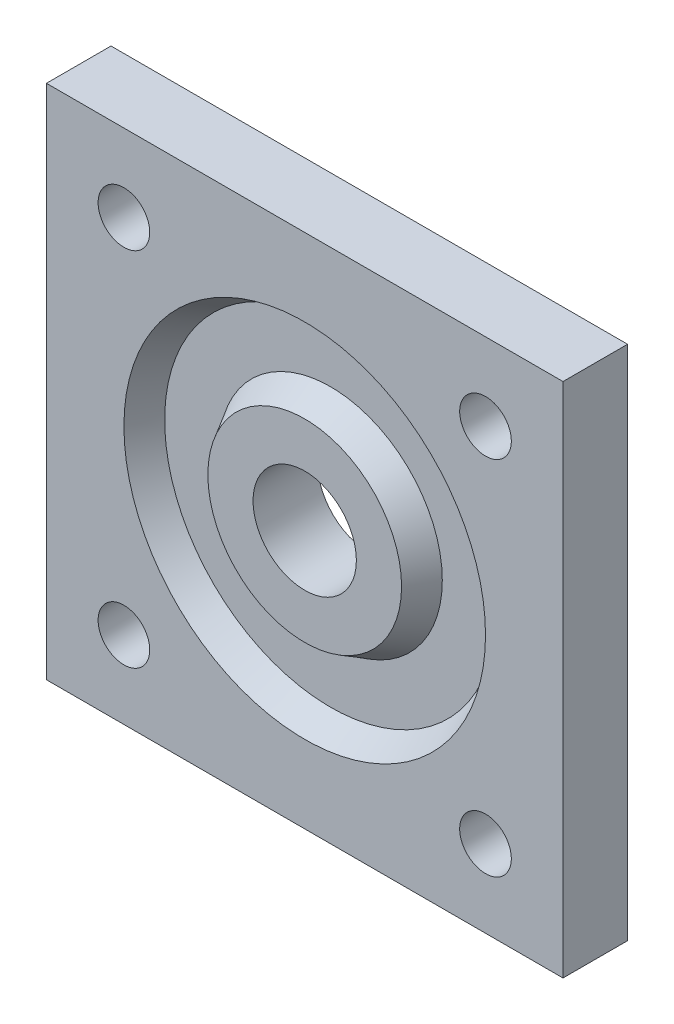
ISO-10303-21;
HEADER;
FILE_DESCRIPTION(('STEP AP214'),'2;1');
FILE_NAME('part.step','',(''),(''),'','','');
FILE_SCHEMA(('AUTOMOTIVE_DESIGN { 1 0 10303 214 1 1 1 1 }'));
ENDSEC;
DATA;
#1=APPLICATION_CONTEXT('core data for automotive mechanical design processes');
#2=APPLICATION_PROTOCOL_DEFINITION('international standard','automotive_design',2000,#1);
#3=PRODUCT_CONTEXT('',#1,'mechanical');
#4=PRODUCT('Part','Part','',(#3));
#5=PRODUCT_RELATED_PRODUCT_CATEGORY('part','',(#4));
#6=PRODUCT_DEFINITION_FORMATION('','',#4);
#7=PRODUCT_DEFINITION_CONTEXT('part definition',#1,'design');
#8=PRODUCT_DEFINITION('design','',#6,#7);
#9=PRODUCT_DEFINITION_SHAPE('','',#8);
#10=(LENGTH_UNIT() NAMED_UNIT(*) SI_UNIT(.MILLI.,.METRE.));
#11=(NAMED_UNIT(*) PLANE_ANGLE_UNIT() SI_UNIT($,.RADIAN.));
#12=(NAMED_UNIT(*) SI_UNIT($,.STERADIAN.) SOLID_ANGLE_UNIT());
#13=UNCERTAINTY_MEASURE_WITH_UNIT(LENGTH_MEASURE(1.E-05),#10,'distance_accuracy_value','');
#14=(GEOMETRIC_REPRESENTATION_CONTEXT(3) GLOBAL_UNCERTAINTY_ASSIGNED_CONTEXT((#13)) GLOBAL_UNIT_ASSIGNED_CONTEXT((#10,
#11,#12)) REPRESENTATION_CONTEXT('',''));
#15=CARTESIAN_POINT('',(0.,0.,0.));
#16=DIRECTION('',(0.,0.,1.));
#17=DIRECTION('',(1.,0.,0.));
#18=AXIS2_PLACEMENT_3D('',#15,#16,#17);
#19=CARTESIAN_POINT('',(20.,-20.,5.));
#20=DIRECTION('',(-1.,0.,0.));
#21=DIRECTION('',(0.,0.,1.));
#22=AXIS2_PLACEMENT_3D('',#19,#20,#21);
#23=PLANE('',#22);
#24=DIRECTION('',(0.,1.,0.));
#25=VECTOR('',#24,1.);
#26=CARTESIAN_POINT('',(20.,-20.,0.));
#27=LINE('',#26,#25);
#28=CARTESIAN_POINT('',(20.,-20.,0.));
#29=VERTEX_POINT('',#28);
#30=CARTESIAN_POINT('',(20.,20.,0.));
#31=VERTEX_POINT('',#30);
#32=EDGE_CURVE('E99',#29,#31,#27,.T.);
#33=ORIENTED_EDGE('',*,*,#32,.T.);
#34=DIRECTION('',(0.,0.,-1.));
#35=VECTOR('',#34,1.);
#36=CARTESIAN_POINT('',(20.,20.,5.));
#37=LINE('',#36,#35);
#38=CARTESIAN_POINT('',(20.,20.,5.));
#39=VERTEX_POINT('',#38);
#40=EDGE_CURVE('E11',#39,#31,#37,.T.);
#41=ORIENTED_EDGE('',*,*,#40,.F.);
#42=DIRECTION('',(0.,1.,0.));
#43=VECTOR('',#42,1.);
#44=CARTESIAN_POINT('',(20.,-20.,5.));
#45=LINE('',#44,#43);
#46=CARTESIAN_POINT('',(20.,-20.,5.));
#47=VERTEX_POINT('',#46);
#48=EDGE_CURVE('E87',#47,#39,#45,.T.);
#49=ORIENTED_EDGE('',*,*,#48,.F.);
#50=DIRECTION('',(0.,0.,-1.));
#51=VECTOR('',#50,1.);
#52=CARTESIAN_POINT('',(20.,-20.,5.));
#53=LINE('',#52,#51);
#54=EDGE_CURVE('E95',#47,#29,#53,.T.);
#55=ORIENTED_EDGE('',*,*,#54,.T.);
#56=EDGE_LOOP('',(#33,#41,#49,#55));
#57=FACE_BOUND('',#56,.T.);
#58=ADVANCED_FACE('F36',(#57),#23,.F.);
#59=CARTESIAN_POINT('',(-20.,20.,5.));
#60=DIRECTION('',(0.,-1.,0.));
#61=DIRECTION('',(0.,0.,-1.));
#62=AXIS2_PLACEMENT_3D('',#59,#60,#61);
#63=PLANE('',#62);
#64=DIRECTION('',(-1.,0.,0.));
#65=VECTOR('',#64,1.);
#66=CARTESIAN_POINT('',(-20.,20.,0.));
#67=LINE('',#66,#65);
#68=CARTESIAN_POINT('',(-20.,20.,0.));
#69=VERTEX_POINT('',#68);
#70=EDGE_CURVE('E91',#31,#69,#67,.T.);
#71=ORIENTED_EDGE('',*,*,#70,.T.);
#72=DIRECTION('',(0.,0.,-1.));
#73=VECTOR('',#72,1.);
#74=CARTESIAN_POINT('',(-20.,20.,5.));
#75=LINE('',#74,#73);
#76=CARTESIAN_POINT('',(-20.,20.,5.));
#77=VERTEX_POINT('',#76);
#78=EDGE_CURVE('E44',#77,#69,#75,.T.);
#79=ORIENTED_EDGE('',*,*,#78,.F.);
#80=DIRECTION('',(-1.,0.,0.));
#81=VECTOR('',#80,1.);
#82=CARTESIAN_POINT('',(-20.,20.,5.));
#83=LINE('',#82,#81);
#84=EDGE_CURVE('E82',#39,#77,#83,.T.);
#85=ORIENTED_EDGE('',*,*,#84,.F.);
#86=ORIENTED_EDGE('',*,*,#40,.T.);
#87=EDGE_LOOP('',(#71,#79,#85,#86));
#88=FACE_BOUND('',#87,.T.);
#89=ADVANCED_FACE('F90',(#88),#63,.F.);
#90=CARTESIAN_POINT('',(-20.,-20.,5.));
#91=DIRECTION('',(1.,0.,0.));
#92=DIRECTION('',(0.,0.,-1.));
#93=AXIS2_PLACEMENT_3D('',#90,#91,#92);
#94=PLANE('',#93);
#95=DIRECTION('',(0.,-1.,0.));
#96=VECTOR('',#95,1.);
#97=CARTESIAN_POINT('',(-20.,-20.,0.));
#98=LINE('',#97,#96);
#99=CARTESIAN_POINT('',(-20.,-20.,0.));
#100=VERTEX_POINT('',#99);
#101=EDGE_CURVE('E69',#69,#100,#98,.T.);
#102=ORIENTED_EDGE('',*,*,#101,.T.);
#103=DIRECTION('',(0.,0.,-1.));
#104=VECTOR('',#103,1.);
#105=CARTESIAN_POINT('',(-20.,-20.,5.));
#106=LINE('',#105,#104);
#107=CARTESIAN_POINT('',(-20.,-20.,5.));
#108=VERTEX_POINT('',#107);
#109=EDGE_CURVE('E92',#108,#100,#106,.T.);
#110=ORIENTED_EDGE('',*,*,#109,.F.);
#111=DIRECTION('',(0.,-1.,0.));
#112=VECTOR('',#111,1.);
#113=CARTESIAN_POINT('',(-20.,-20.,5.));
#114=LINE('',#113,#112);
#115=EDGE_CURVE('E85',#77,#108,#114,.T.);
#116=ORIENTED_EDGE('',*,*,#115,.F.);
#117=ORIENTED_EDGE('',*,*,#78,.T.);
#118=EDGE_LOOP('',(#102,#110,#116,#117));
#119=FACE_BOUND('',#118,.T.);
#120=ADVANCED_FACE('F93',(#119),#94,.F.);
#121=CARTESIAN_POINT('',(-20.,-20.,5.));
#122=DIRECTION('',(0.,1.,0.));
#123=DIRECTION('',(0.,0.,1.));
#124=AXIS2_PLACEMENT_3D('',#121,#122,#123);
#125=PLANE('',#124);
#126=DIRECTION('',(1.,0.,0.));
#127=VECTOR('',#126,1.);
#128=CARTESIAN_POINT('',(-20.,-20.,0.));
#129=LINE('',#128,#127);
#130=EDGE_CURVE('E75',#100,#29,#129,.T.);
#131=ORIENTED_EDGE('',*,*,#130,.T.);
#132=ORIENTED_EDGE('',*,*,#54,.F.);
#133=DIRECTION('',(1.,0.,0.));
#134=VECTOR('',#133,1.);
#135=CARTESIAN_POINT('',(-20.,-20.,5.));
#136=LINE('',#135,#134);
#137=EDGE_CURVE('E52',#108,#47,#136,.T.);
#138=ORIENTED_EDGE('',*,*,#137,.F.);
#139=ORIENTED_EDGE('',*,*,#109,.T.);
#140=EDGE_LOOP('',(#131,#132,#138,#139));
#141=FACE_BOUND('',#140,.T.);
#142=ADVANCED_FACE('F107',(#141),#125,.F.);
#143=CARTESIAN_POINT('',(0.,0.,5.));
#144=DIRECTION('',(0.,0.,-1.));
#145=DIRECTION('',(-1.,0.,0.));
#146=AXIS2_PLACEMENT_3D('',#143,#144,#145);
#147=PLANE('',#146);
#148=CARTESIAN_POINT('',(-13.9999999999992,-14.,5.));
#149=DIRECTION('',(0.,0.,1.));
#150=DIRECTION('',(1.,0.,0.));
#151=AXIS2_PLACEMENT_3D('',#148,#149,#150);
#152=CIRCLE('',#151,2.00000000000042);
#153=CARTESIAN_POINT('',(-11.9999999999988,-14.,5.));
#154=VERTEX_POINT('',#153);
#155=EDGE_CURVE('E137',#154,#154,#152,.T.);
#156=ORIENTED_EDGE('',*,*,#155,.F.);
#157=EDGE_LOOP('',(#156));
#158=FACE_BOUND('',#157,.T.);
#159=CARTESIAN_POINT('',(14.0000000000008,-13.9999999999992,5.));
#160=DIRECTION('',(0.,0.,1.));
#161=DIRECTION('',(1.,0.,0.));
#162=AXIS2_PLACEMENT_3D('',#159,#160,#161);
#163=CIRCLE('',#162,2.00000000000111);
#164=CARTESIAN_POINT('',(16.0000000000019,-13.9999999999992,5.));
#165=VERTEX_POINT('',#164);
#166=EDGE_CURVE('E143',#165,#165,#163,.T.);
#167=ORIENTED_EDGE('',*,*,#166,.F.);
#168=EDGE_LOOP('',(#167));
#169=FACE_BOUND('',#168,.T.);
#170=CARTESIAN_POINT('',(14.,14.0000000000008,5.));
#171=DIRECTION('',(0.,0.,1.));
#172=DIRECTION('',(1.,0.,0.));
#173=AXIS2_PLACEMENT_3D('',#170,#171,#172);
#174=CIRCLE('',#173,2.00000000000081);
#175=CARTESIAN_POINT('',(16.0000000000008,14.0000000000008,5.));
#176=VERTEX_POINT('',#175);
#177=EDGE_CURVE('E149',#176,#176,#174,.T.);
#178=ORIENTED_EDGE('',*,*,#177,.F.);
#179=EDGE_LOOP('',(#178));
#180=FACE_BOUND('',#179,.T.);
#181=CARTESIAN_POINT('',(-14.,14.,5.));
#182=DIRECTION('',(0.,0.,1.));
#183=DIRECTION('',(1.,0.,0.));
#184=AXIS2_PLACEMENT_3D('',#181,#182,#183);
#185=CIRCLE('',#184,2.);
#186=CARTESIAN_POINT('',(-12.,14.,5.));
#187=VERTEX_POINT('',#186);
#188=EDGE_CURVE('E131',#187,#187,#185,.T.);
#189=ORIENTED_EDGE('',*,*,#188,.F.);
#190=EDGE_LOOP('',(#189));
#191=FACE_BOUND('',#190,.T.);
#192=CARTESIAN_POINT('',(0.,0.,5.));
#193=DIRECTION('',(0.,0.,1.));
#194=DIRECTION('',(1.,0.,0.));
#195=AXIS2_PLACEMENT_3D('',#192,#193,#194);
#196=CIRCLE('',#195,14.);
#197=CARTESIAN_POINT('',(14.,0.,5.));
#198=VERTEX_POINT('',#197);
#199=EDGE_CURVE('E115',#198,#198,#196,.T.);
#200=ORIENTED_EDGE('',*,*,#199,.F.);
#201=EDGE_LOOP('',(#200));
#202=FACE_BOUND('',#201,.T.);
#203=ORIENTED_EDGE('',*,*,#48,.T.);
#204=ORIENTED_EDGE('',*,*,#84,.T.);
#205=ORIENTED_EDGE('',*,*,#115,.T.);
#206=ORIENTED_EDGE('',*,*,#137,.T.);
#207=EDGE_LOOP('',(#203,#204,#205,#206));
#208=FACE_BOUND('',#207,.T.);
#209=ADVANCED_FACE('F83',(#158,#169,#180,#191,#202,#208),#147,.F.);
#210=CARTESIAN_POINT('',(0.,0.,0.));
#211=DIRECTION('',(0.,0.,-1.));
#212=DIRECTION('',(-1.,0.,0.));
#213=AXIS2_PLACEMENT_3D('',#210,#211,#212);
#214=PLANE('',#213);
#215=CARTESIAN_POINT('',(-13.9999999999992,-14.,0.));
#216=DIRECTION('',(0.,0.,1.));
#217=DIRECTION('',(1.,0.,0.));
#218=AXIS2_PLACEMENT_3D('',#215,#216,#217);
#219=CIRCLE('',#218,2.00000000000042);
#220=CARTESIAN_POINT('',(-11.9999999999988,-14.,0.));
#221=VERTEX_POINT('',#220);
#222=EDGE_CURVE('E140',#221,#221,#219,.T.);
#223=ORIENTED_EDGE('',*,*,#222,.T.);
#224=EDGE_LOOP('',(#223));
#225=FACE_BOUND('',#224,.T.);
#226=CARTESIAN_POINT('',(14.0000000000008,-13.9999999999992,0.));
#227=DIRECTION('',(0.,0.,1.));
#228=DIRECTION('',(1.,0.,0.));
#229=AXIS2_PLACEMENT_3D('',#226,#227,#228);
#230=CIRCLE('',#229,2.00000000000111);
#231=CARTESIAN_POINT('',(16.0000000000019,-13.9999999999992,0.));
#232=VERTEX_POINT('',#231);
#233=EDGE_CURVE('E146',#232,#232,#230,.T.);
#234=ORIENTED_EDGE('',*,*,#233,.T.);
#235=EDGE_LOOP('',(#234));
#236=FACE_BOUND('',#235,.T.);
#237=CARTESIAN_POINT('',(14.,14.0000000000008,0.));
#238=DIRECTION('',(0.,0.,1.));
#239=DIRECTION('',(1.,0.,0.));
#240=AXIS2_PLACEMENT_3D('',#237,#238,#239);
#241=CIRCLE('',#240,2.00000000000081);
#242=CARTESIAN_POINT('',(16.0000000000008,14.0000000000008,0.));
#243=VERTEX_POINT('',#242);
#244=EDGE_CURVE('E134',#243,#243,#241,.T.);
#245=ORIENTED_EDGE('',*,*,#244,.T.);
#246=EDGE_LOOP('',(#245));
#247=FACE_BOUND('',#246,.T.);
#248=CARTESIAN_POINT('',(-14.,14.,0.));
#249=DIRECTION('',(0.,0.,1.));
#250=DIRECTION('',(1.,0.,0.));
#251=AXIS2_PLACEMENT_3D('',#248,#249,#250);
#252=CIRCLE('',#251,2.);
#253=CARTESIAN_POINT('',(-12.,14.,0.));
#254=VERTEX_POINT('',#253);
#255=EDGE_CURVE('E128',#254,#254,#252,.T.);
#256=ORIENTED_EDGE('',*,*,#255,.T.);
#257=EDGE_LOOP('',(#256));
#258=FACE_BOUND('',#257,.T.);
#259=CARTESIAN_POINT('',(0.,0.,0.));
#260=DIRECTION('',(0.,0.,1.));
#261=DIRECTION('',(1.,0.,0.));
#262=AXIS2_PLACEMENT_3D('',#259,#260,#261);
#263=CIRCLE('',#262,4.);
#264=CARTESIAN_POINT('',(4.,0.,0.));
#265=VERTEX_POINT('',#264);
#266=EDGE_CURVE('E124',#265,#265,#263,.T.);
#267=ORIENTED_EDGE('',*,*,#266,.T.);
#268=EDGE_LOOP('',(#267));
#269=FACE_BOUND('',#268,.T.);
#270=ORIENTED_EDGE('',*,*,#32,.F.);
#271=ORIENTED_EDGE('',*,*,#130,.F.);
#272=ORIENTED_EDGE('',*,*,#101,.F.);
#273=ORIENTED_EDGE('',*,*,#70,.F.);
#274=EDGE_LOOP('',(#270,#271,#272,#273));
#275=FACE_BOUND('',#274,.T.);
#276=ADVANCED_FACE('F110',(#225,#236,#247,#258,#269,#275),#214,.T.);
#277=CARTESIAN_POINT('',(0.,0.,5.));
#278=DIRECTION('',(0.,0.,1.));
#279=DIRECTION('',(1.,0.,0.));
#280=AXIS2_PLACEMENT_3D('',#277,#278,#279);
#281=CONICAL_SURFACE('',#280,14.,0.5235987755983);
#282=CARTESIAN_POINT('',(0.,0.,3.));
#283=DIRECTION('',(0.,0.,1.));
#284=DIRECTION('',(1.,0.,0.));
#285=AXIS2_PLACEMENT_3D('',#282,#283,#284);
#286=CIRCLE('',#285,12.8452994616207);
#287=CARTESIAN_POINT('',(12.8452994616207,0.,3.));
#288=VERTEX_POINT('',#287);
#289=EDGE_CURVE('E102',#288,#288,#286,.T.);
#290=ORIENTED_EDGE('',*,*,#289,.F.);
#291=EDGE_LOOP('',(#290));
#292=FACE_BOUND('',#291,.T.);
#293=ORIENTED_EDGE('',*,*,#199,.T.);
#294=EDGE_LOOP('',(#293));
#295=FACE_BOUND('',#294,.T.);
#296=ADVANCED_FACE('F174',(#292,#295),#281,.F.);
#297=CARTESIAN_POINT('',(0.,0.,3.));
#298=DIRECTION('',(0.,0.,1.));
#299=DIRECTION('',(1.,0.,0.));
#300=AXIS2_PLACEMENT_3D('',#297,#298,#299);
#301=PLANE('',#300);
#302=CARTESIAN_POINT('',(0.,0.,3.));
#303=DIRECTION('',(0.,0.,1.));
#304=DIRECTION('',(1.,0.,0.));
#305=AXIS2_PLACEMENT_3D('',#302,#303,#304);
#306=CIRCLE('',#305,8.65470053837925);
#307=CARTESIAN_POINT('',(8.65470053837925,0.,3.));
#308=VERTEX_POINT('',#307);
#309=EDGE_CURVE('E116',#308,#308,#306,.T.);
#310=ORIENTED_EDGE('',*,*,#309,.F.);
#311=EDGE_LOOP('',(#310));
#312=FACE_BOUND('',#311,.T.);
#313=ORIENTED_EDGE('',*,*,#289,.T.);
#314=EDGE_LOOP('',(#313));
#315=FACE_BOUND('',#314,.T.);
#316=ADVANCED_FACE('F176',(#312,#315),#301,.T.);
#317=CARTESIAN_POINT('',(0.,0.,5.));
#318=DIRECTION('',(0.,0.,-1.));
#319=DIRECTION('',(1.,0.,0.));
#320=AXIS2_PLACEMENT_3D('',#317,#318,#319);
#321=CONICAL_SURFACE('',#320,7.5,0.5235987755983);
#322=ORIENTED_EDGE('',*,*,#309,.T.);
#323=EDGE_LOOP('',(#322));
#324=FACE_BOUND('',#323,.T.);
#325=CARTESIAN_POINT('',(0.,0.,5.));
#326=DIRECTION('',(0.,0.,1.));
#327=DIRECTION('',(1.,0.,0.));
#328=AXIS2_PLACEMENT_3D('',#325,#326,#327);
#329=CIRCLE('',#328,7.5);
#330=CARTESIAN_POINT('',(7.5,0.,5.));
#331=VERTEX_POINT('',#330);
#332=EDGE_CURVE('E119',#331,#331,#329,.T.);
#333=ORIENTED_EDGE('',*,*,#332,.F.);
#334=EDGE_LOOP('',(#333));
#335=FACE_BOUND('',#334,.T.);
#336=ADVANCED_FACE('F183',(#324,#335),#321,.T.);
#337=CARTESIAN_POINT('',(0.,0.,5.));
#338=DIRECTION('',(0.,0.,1.));
#339=DIRECTION('',(1.,0.,0.));
#340=AXIS2_PLACEMENT_3D('',#337,#338,#339);
#341=CIRCLE('',#340,4.);
#342=CARTESIAN_POINT('',(4.,0.,5.));
#343=VERTEX_POINT('',#342);
#344=EDGE_CURVE('E125',#343,#343,#341,.T.);
#345=ORIENTED_EDGE('',*,*,#344,.F.);
#346=EDGE_LOOP('',(#345));
#347=FACE_BOUND('',#346,.T.);
#348=ORIENTED_EDGE('',*,*,#332,.T.);
#349=EDGE_LOOP('',(#348));
#350=FACE_BOUND('',#349,.T.);
#351=ADVANCED_FACE('F169',(#347,#350),#147,.F.);
#352=CARTESIAN_POINT('',(0.,0.,0.));
#353=DIRECTION('',(0.,0.,1.));
#354=DIRECTION('',(1.,0.,0.));
#355=AXIS2_PLACEMENT_3D('',#352,#353,#354);
#356=CYLINDRICAL_SURFACE('',#355,4.);
#357=ORIENTED_EDGE('',*,*,#266,.F.);
#358=EDGE_LOOP('',(#357));
#359=FACE_BOUND('',#358,.T.);
#360=ORIENTED_EDGE('',*,*,#344,.T.);
#361=EDGE_LOOP('',(#360));
#362=FACE_BOUND('',#361,.T.);
#363=ADVANCED_FACE('F223',(#359,#362),#356,.F.);
#364=CARTESIAN_POINT('',(-14.,14.,0.));
#365=DIRECTION('',(0.,0.,1.));
#366=DIRECTION('',(1.,0.,0.));
#367=AXIS2_PLACEMENT_3D('',#364,#365,#366);
#368=CYLINDRICAL_SURFACE('',#367,2.);
#369=ORIENTED_EDGE('',*,*,#255,.F.);
#370=EDGE_LOOP('',(#369));
#371=FACE_BOUND('',#370,.T.);
#372=ORIENTED_EDGE('',*,*,#188,.T.);
#373=EDGE_LOOP('',(#372));
#374=FACE_BOUND('',#373,.T.);
#375=ADVANCED_FACE('F161',(#371,#374),#368,.F.);
#376=CARTESIAN_POINT('',(14.,14.0000000000008,0.));
#377=DIRECTION('',(0.,0.,1.));
#378=DIRECTION('',(1.,0.,0.));
#379=AXIS2_PLACEMENT_3D('',#376,#377,#378);
#380=CYLINDRICAL_SURFACE('',#379,2.00000000000081);
#381=ORIENTED_EDGE('',*,*,#244,.F.);
#382=EDGE_LOOP('',(#381));
#383=FACE_BOUND('',#382,.T.);
#384=ORIENTED_EDGE('',*,*,#177,.T.);
#385=EDGE_LOOP('',(#384));
#386=FACE_BOUND('',#385,.T.);
#387=ADVANCED_FACE('F157',(#383,#386),#380,.F.);
#388=CARTESIAN_POINT('',(14.0000000000008,-13.9999999999992,0.));
#389=DIRECTION('',(0.,0.,1.));
#390=DIRECTION('',(1.,0.,0.));
#391=AXIS2_PLACEMENT_3D('',#388,#389,#390);
#392=CYLINDRICAL_SURFACE('',#391,2.00000000000111);
#393=ORIENTED_EDGE('',*,*,#233,.F.);
#394=EDGE_LOOP('',(#393));
#395=FACE_BOUND('',#394,.T.);
#396=ORIENTED_EDGE('',*,*,#166,.T.);
#397=EDGE_LOOP('',(#396));
#398=FACE_BOUND('',#397,.T.);
#399=ADVANCED_FACE('F160',(#395,#398),#392,.F.);
#400=CARTESIAN_POINT('',(-13.9999999999992,-14.,0.));
#401=DIRECTION('',(0.,0.,1.));
#402=DIRECTION('',(1.,0.,0.));
#403=AXIS2_PLACEMENT_3D('',#400,#401,#402);
#404=CYLINDRICAL_SURFACE('',#403,2.00000000000042);
#405=ORIENTED_EDGE('',*,*,#222,.F.);
#406=EDGE_LOOP('',(#405));
#407=FACE_BOUND('',#406,.T.);
#408=ORIENTED_EDGE('',*,*,#155,.T.);
#409=EDGE_LOOP('',(#408));
#410=FACE_BOUND('',#409,.T.);
#411=ADVANCED_FACE('F241',(#407,#410),#404,.F.);
#412=CLOSED_SHELL('',(#58,#89,#120,#142,#209,#276,#296,#316,#336,#351,#363,#375,#387,#399,#411));
#413=MANIFOLD_SOLID_BREP('B2',#412);
#414=ADVANCED_BREP_SHAPE_REPRESENTATION('',(#18,#413),#14);
#415=SHAPE_DEFINITION_REPRESENTATION(#9,#414);
ENDSEC;
END-ISO-10303-21;
